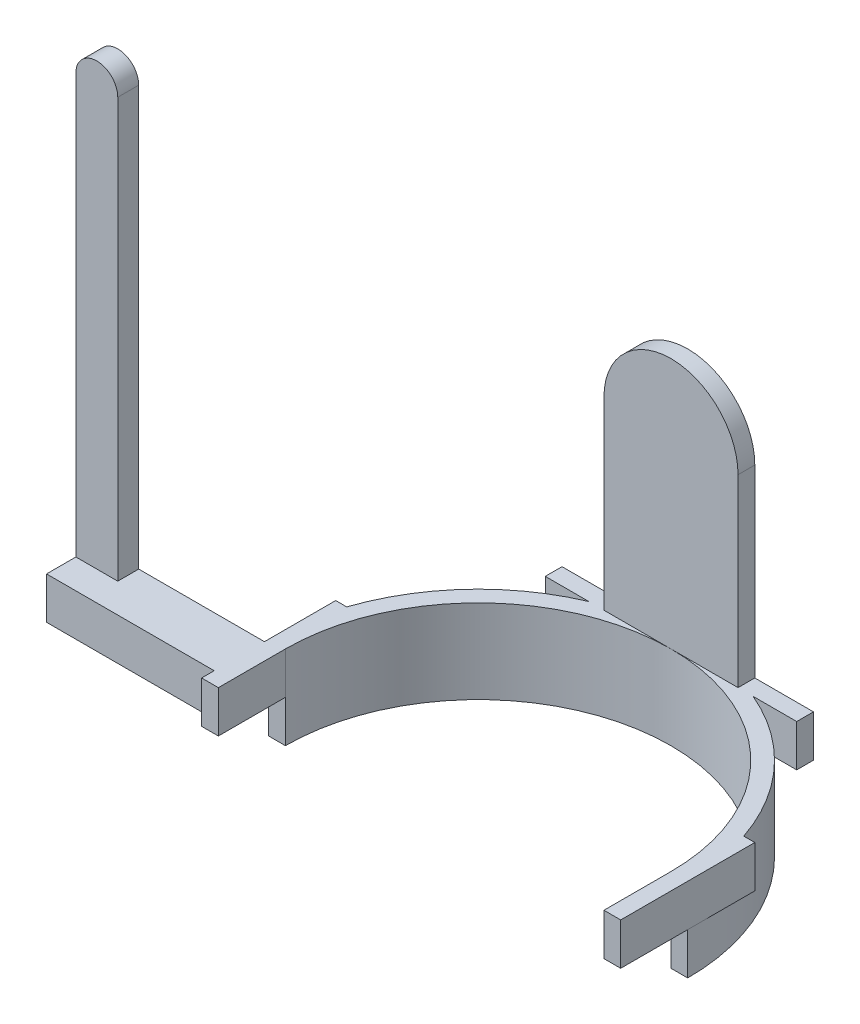
ISO-10303-21;
HEADER;
FILE_DESCRIPTION(('STEP AP214'),'2;1');
FILE_NAME('part.step','',(''),(''),'','','');
FILE_SCHEMA(('AUTOMOTIVE_DESIGN { 1 0 10303 214 1 1 1 1 }'));
ENDSEC;
DATA;
#1=APPLICATION_CONTEXT('core data for automotive mechanical design processes');
#2=APPLICATION_PROTOCOL_DEFINITION('international standard','automotive_design',2000,#1);
#3=PRODUCT_CONTEXT('',#1,'mechanical');
#4=PRODUCT('Part','Part','',(#3));
#5=PRODUCT_RELATED_PRODUCT_CATEGORY('part','',(#4));
#6=PRODUCT_DEFINITION_FORMATION('','',#4);
#7=PRODUCT_DEFINITION_CONTEXT('part definition',#1,'design');
#8=PRODUCT_DEFINITION('design','',#6,#7);
#9=PRODUCT_DEFINITION_SHAPE('','',#8);
#10=(LENGTH_UNIT() NAMED_UNIT(*) SI_UNIT(.MILLI.,.METRE.));
#11=(NAMED_UNIT(*) PLANE_ANGLE_UNIT() SI_UNIT($,.RADIAN.));
#12=(NAMED_UNIT(*) SI_UNIT($,.STERADIAN.) SOLID_ANGLE_UNIT());
#13=UNCERTAINTY_MEASURE_WITH_UNIT(LENGTH_MEASURE(1.E-05),#10,'distance_accuracy_value','');
#14=(GEOMETRIC_REPRESENTATION_CONTEXT(3) GLOBAL_UNCERTAINTY_ASSIGNED_CONTEXT((#13)) GLOBAL_UNIT_ASSIGNED_CONTEXT((#10,
#11,#12)) REPRESENTATION_CONTEXT('',''));
#15=CARTESIAN_POINT('',(0.,0.,0.));
#16=DIRECTION('',(0.,0.,1.));
#17=DIRECTION('',(1.,0.,0.));
#18=AXIS2_PLACEMENT_3D('',#15,#16,#17);
#19=CARTESIAN_POINT('',(0.,20.,0.));
#20=DIRECTION('',(0.,-1.,0.));
#21=DIRECTION('',(0.,0.,-1.));
#22=AXIS2_PLACEMENT_3D('',#19,#20,#21);
#23=PLANE('',#22);
#24=DIRECTION('',(1.,0.,0.));
#25=VECTOR('',#24,1.);
#26=CARTESIAN_POINT('',(-90.,20.,6.));
#27=LINE('',#26,#25);
#28=CARTESIAN_POINT('',(-90.,20.,6.));
#29=VERTEX_POINT('',#28);
#30=CARTESIAN_POINT('',(-80.,20.,6.));
#31=VERTEX_POINT('',#30);
#32=EDGE_CURVE('E262',#29,#31,#27,.T.);
#33=ORIENTED_EDGE('',*,*,#32,.F.);
#34=DIRECTION('',(0.,0.,-1.));
#35=VECTOR('',#34,1.);
#36=CARTESIAN_POINT('',(-90.,20.,1.));
#37=LINE('',#36,#35);
#38=CARTESIAN_POINT('',(-90.,20.,13.));
#39=VERTEX_POINT('',#38);
#40=EDGE_CURVE('E287',#39,#29,#37,.T.);
#41=ORIENTED_EDGE('',*,*,#40,.F.);
#42=DIRECTION('',(1.,0.,0.));
#43=VECTOR('',#42,1.);
#44=CARTESIAN_POINT('',(-90.,20.,13.));
#45=LINE('',#44,#43);
#46=CARTESIAN_POINT('',(-50.,20.,13.));
#47=VERTEX_POINT('',#46);
#48=EDGE_CURVE('E55',#39,#47,#45,.T.);
#49=ORIENTED_EDGE('',*,*,#48,.T.);
#50=DIRECTION('',(0.,0.,1.));
#51=VECTOR('',#50,1.);
#52=CARTESIAN_POINT('',(-50.,20.,-16.));
#53=LINE('',#52,#51);
#54=CARTESIAN_POINT('',(-50.,20.,16.));
#55=VERTEX_POINT('',#54);
#56=EDGE_CURVE('E330',#47,#55,#53,.T.);
#57=ORIENTED_EDGE('',*,*,#56,.T.);
#58=DIRECTION('',(1.,0.,0.));
#59=VECTOR('',#58,1.);
#60=CARTESIAN_POINT('',(-50.,20.,16.));
#61=LINE('',#60,#59);
#62=CARTESIAN_POINT('',(-46.,20.,16.));
#63=VERTEX_POINT('',#62);
#64=EDGE_CURVE('E334',#55,#63,#61,.T.);
#65=ORIENTED_EDGE('',*,*,#64,.T.);
#66=DIRECTION('',(0.,0.,-1.));
#67=VECTOR('',#66,1.);
#68=CARTESIAN_POINT('',(-46.,20.,0.));
#69=LINE('',#68,#67);
#70=CARTESIAN_POINT('',(-46.,20.,0.));
#71=VERTEX_POINT('',#70);
#72=EDGE_CURVE('E336',#63,#71,#69,.T.);
#73=ORIENTED_EDGE('',*,*,#72,.T.);
#74=CARTESIAN_POINT('',(0.,20.,0.));
#75=DIRECTION('',(0.,-1.,0.));
#76=DIRECTION('',(0.,0.,-1.));
#77=AXIS2_PLACEMENT_3D('',#74,#75,#76);
#78=CIRCLE('',#77,46.);
#79=CARTESIAN_POINT('',(0.,20.,-46.));
#80=VERTEX_POINT('',#79);
#81=EDGE_CURVE('E339',#71,#80,#78,.T.);
#82=ORIENTED_EDGE('',*,*,#81,.T.);
#83=DIRECTION('',(1.,0.,0.));
#84=VECTOR('',#83,1.);
#85=CARTESIAN_POINT('',(-16.,20.,-46.));
#86=LINE('',#85,#84);
#87=CARTESIAN_POINT('',(-16.,20.,-46.));
#88=VERTEX_POINT('',#87);
#89=EDGE_CURVE('E48',#88,#80,#86,.T.);
#90=ORIENTED_EDGE('',*,*,#89,.F.);
#91=DIRECTION('',(0.,0.,1.));
#92=VECTOR('',#91,1.);
#93=CARTESIAN_POINT('',(-16.,20.,-50.));
#94=LINE('',#93,#92);
#95=CARTESIAN_POINT('',(-16.,20.,-50.));
#96=VERTEX_POINT('',#95);
#97=EDGE_CURVE('E308',#96,#88,#94,.T.);
#98=ORIENTED_EDGE('',*,*,#97,.F.);
#99=DIRECTION('',(-1.,0.,0.));
#100=VECTOR('',#99,1.);
#101=CARTESIAN_POINT('',(-30.,20.,-50.));
#102=LINE('',#101,#100);
#103=CARTESIAN_POINT('',(-30.,20.,-50.));
#104=VERTEX_POINT('',#103);
#105=EDGE_CURVE('E356',#96,#104,#102,.T.);
#106=ORIENTED_EDGE('',*,*,#105,.T.);
#107=DIRECTION('',(0.,0.,1.));
#108=VECTOR('',#107,1.);
#109=CARTESIAN_POINT('',(-30.,20.,-50.));
#110=LINE('',#109,#108);
#111=CARTESIAN_POINT('',(-30.,20.,-46.));
#112=VERTEX_POINT('',#111);
#113=EDGE_CURVE('E360',#104,#112,#110,.T.);
#114=ORIENTED_EDGE('',*,*,#113,.T.);
#115=DIRECTION('',(1.,0.,0.));
#116=VECTOR('',#115,1.);
#117=CARTESIAN_POINT('',(-30.,20.,-46.));
#118=LINE('',#117,#116);
#119=CARTESIAN_POINT('',(-19.5959179422654,20.,-46.));
#120=VERTEX_POINT('',#119);
#121=EDGE_CURVE('E362',#112,#120,#118,.T.);
#122=ORIENTED_EDGE('',*,*,#121,.T.);
#123=CARTESIAN_POINT('',(0.,20.,0.));
#124=DIRECTION('',(0.,1.,0.));
#125=DIRECTION('',(0.,0.,-1.));
#126=AXIS2_PLACEMENT_3D('',#123,#124,#125);
#127=CIRCLE('',#126,50.);
#128=CARTESIAN_POINT('',(-47.370877129308,20.,-16.));
#129=VERTEX_POINT('',#128);
#130=EDGE_CURVE('E324',#120,#129,#127,.T.);
#131=ORIENTED_EDGE('',*,*,#130,.T.);
#132=DIRECTION('',(-1.,0.,0.));
#133=VECTOR('',#132,1.);
#134=CARTESIAN_POINT('',(-50.,20.,-16.));
#135=LINE('',#134,#133);
#136=CARTESIAN_POINT('',(-50.,20.,-16.));
#137=VERTEX_POINT('',#136);
#138=EDGE_CURVE('E327',#129,#137,#135,.T.);
#139=ORIENTED_EDGE('',*,*,#138,.T.);
#140=CARTESIAN_POINT('',(-50.,20.,1.));
#141=VERTEX_POINT('',#140);
#142=EDGE_CURVE('E331',#137,#141,#53,.T.);
#143=ORIENTED_EDGE('',*,*,#142,.T.);
#144=DIRECTION('',(1.,0.,0.));
#145=VECTOR('',#144,1.);
#146=CARTESIAN_POINT('',(-90.,20.,1.));
#147=LINE('',#146,#145);
#148=CARTESIAN_POINT('',(-80.,20.,1.));
#149=VERTEX_POINT('',#148);
#150=EDGE_CURVE('E290',#149,#141,#147,.T.);
#151=ORIENTED_EDGE('',*,*,#150,.F.);
#152=DIRECTION('',(0.,0.,-1.));
#153=VECTOR('',#152,1.);
#154=CARTESIAN_POINT('',(-80.,20.,1.));
#155=LINE('',#154,#153);
#156=EDGE_CURVE('E272',#31,#149,#155,.T.);
#157=ORIENTED_EDGE('',*,*,#156,.F.);
#158=EDGE_LOOP('',(#33,#41,#49,#57,#65,#73,#82,#90,#98,#106,#114,#122,#131,#139,#143,#151,#157));
#159=FACE_BOUND('',#158,.T.);
#160=ADVANCED_FACE('F38',(#159),#23,.F.);
#161=CARTESIAN_POINT('',(-50.,20.,-16.));
#162=DIRECTION('',(1.,0.,0.));
#163=DIRECTION('',(0.,0.,-1.));
#164=AXIS2_PLACEMENT_3D('',#161,#162,#163);
#165=PLANE('',#164);
#166=DIRECTION('',(0.,-1.,0.));
#167=VECTOR('',#166,1.);
#168=CARTESIAN_POINT('',(-50.,20.,1.));
#169=LINE('',#168,#167);
#170=CARTESIAN_POINT('',(-50.,10.,1.));
#171=VERTEX_POINT('',#170);
#172=EDGE_CURVE('E278',#141,#171,#169,.T.);
#173=ORIENTED_EDGE('',*,*,#172,.F.);
#174=ORIENTED_EDGE('',*,*,#142,.F.);
#175=DIRECTION('',(0.,-1.,0.));
#176=VECTOR('',#175,1.);
#177=CARTESIAN_POINT('',(-50.,20.,-16.));
#178=LINE('',#177,#176);
#179=CARTESIAN_POINT('',(-50.,10.,-16.));
#180=VERTEX_POINT('',#179);
#181=EDGE_CURVE('E440',#137,#180,#178,.T.);
#182=ORIENTED_EDGE('',*,*,#181,.T.);
#183=DIRECTION('',(0.,0.,1.));
#184=VECTOR('',#183,1.);
#185=CARTESIAN_POINT('',(-50.,10.,-16.));
#186=LINE('',#185,#184);
#187=CARTESIAN_POINT('',(-50.,10.,0.));
#188=VERTEX_POINT('',#187);
#189=EDGE_CURVE('E367',#180,#188,#186,.T.);
#190=ORIENTED_EDGE('',*,*,#189,.T.);
#191=EDGE_CURVE('E371',#188,#171,#186,.T.);
#192=ORIENTED_EDGE('',*,*,#191,.T.);
#193=EDGE_LOOP('',(#173,#174,#182,#190,#192));
#194=FACE_BOUND('',#193,.T.);
#195=ADVANCED_FACE('F552',(#194),#165,.F.);
#196=DIRECTION('',(0.,1.,0.));
#197=VECTOR('',#196,1.);
#198=CARTESIAN_POINT('',(-50.,20.,13.));
#199=LINE('',#198,#197);
#200=CARTESIAN_POINT('',(-50.,10.,13.));
#201=VERTEX_POINT('',#200);
#202=EDGE_CURVE('E283',#201,#47,#199,.T.);
#203=ORIENTED_EDGE('',*,*,#202,.F.);
#204=CARTESIAN_POINT('',(-50.,10.,16.));
#205=VERTEX_POINT('',#204);
#206=EDGE_CURVE('E366',#201,#205,#186,.T.);
#207=ORIENTED_EDGE('',*,*,#206,.T.);
#208=DIRECTION('',(0.,-1.,0.));
#209=VECTOR('',#208,1.);
#210=CARTESIAN_POINT('',(-50.,20.,16.));
#211=LINE('',#210,#209);
#212=EDGE_CURVE('E437',#55,#205,#211,.T.);
#213=ORIENTED_EDGE('',*,*,#212,.F.);
#214=ORIENTED_EDGE('',*,*,#56,.F.);
#215=EDGE_LOOP('',(#203,#207,#213,#214));
#216=FACE_BOUND('',#215,.T.);
#217=ADVANCED_FACE('F570',(#216),#165,.F.);
#218=CARTESIAN_POINT('',(-16.,80.,-50.));
#219=DIRECTION('',(1.,0.,0.));
#220=DIRECTION('',(0.,0.,-1.));
#221=AXIS2_PLACEMENT_3D('',#218,#219,#220);
#222=PLANE('',#221);
#223=DIRECTION('',(0.,0.,-1.));
#224=VECTOR('',#223,1.);
#225=CARTESIAN_POINT('',(-16.,64.,-20.));
#226=LINE('',#225,#224);
#227=CARTESIAN_POINT('',(-16.,64.,-46.));
#228=VERTEX_POINT('',#227);
#229=CARTESIAN_POINT('',(-16.,64.,-50.));
#230=VERTEX_POINT('',#229);
#231=EDGE_CURVE('E302',#228,#230,#226,.T.);
#232=ORIENTED_EDGE('',*,*,#231,.T.);
#233=DIRECTION('',(0.,-1.,0.));
#234=VECTOR('',#233,1.);
#235=CARTESIAN_POINT('',(-16.,80.,-50.));
#236=LINE('',#235,#234);
#237=EDGE_CURVE('E315',#230,#96,#236,.T.);
#238=ORIENTED_EDGE('',*,*,#237,.T.);
#239=ORIENTED_EDGE('',*,*,#97,.T.);
#240=DIRECTION('',(0.,-1.,0.));
#241=VECTOR('',#240,1.);
#242=CARTESIAN_POINT('',(-16.,80.,-46.));
#243=LINE('',#242,#241);
#244=EDGE_CURVE('E321',#228,#88,#243,.T.);
#245=ORIENTED_EDGE('',*,*,#244,.F.);
#246=EDGE_LOOP('',(#232,#238,#239,#245));
#247=FACE_BOUND('',#246,.T.);
#248=ADVANCED_FACE('F524',(#247),#222,.F.);
#249=DIRECTION('',(0.,0.,-1.));
#250=VECTOR('',#249,1.);
#251=CARTESIAN_POINT('',(16.,20.,-50.));
#252=LINE('',#251,#250);
#253=CARTESIAN_POINT('',(16.,20.,-46.));
#254=VERTEX_POINT('',#253);
#255=CARTESIAN_POINT('',(16.,20.,-50.));
#256=VERTEX_POINT('',#255);
#257=EDGE_CURVE('E312',#254,#256,#252,.T.);
#258=ORIENTED_EDGE('',*,*,#257,.F.);
#259=EDGE_CURVE('E11',#80,#254,#86,.T.);
#260=ORIENTED_EDGE('',*,*,#259,.F.);
#261=CARTESIAN_POINT('',(46.,20.,0.));
#262=VERTEX_POINT('',#261);
#263=EDGE_CURVE('E338',#80,#262,#78,.T.);
#264=ORIENTED_EDGE('',*,*,#263,.T.);
#265=DIRECTION('',(0.,0.,1.));
#266=VECTOR('',#265,1.);
#267=CARTESIAN_POINT('',(46.,20.,0.));
#268=LINE('',#267,#266);
#269=CARTESIAN_POINT('',(46.,20.,16.));
#270=VERTEX_POINT('',#269);
#271=EDGE_CURVE('E342',#262,#270,#268,.T.);
#272=ORIENTED_EDGE('',*,*,#271,.T.);
#273=DIRECTION('',(1.,0.,0.));
#274=VECTOR('',#273,1.);
#275=CARTESIAN_POINT('',(50.,20.,16.));
#276=LINE('',#275,#274);
#277=CARTESIAN_POINT('',(50.,20.,16.));
#278=VERTEX_POINT('',#277);
#279=EDGE_CURVE('E344',#270,#278,#276,.T.);
#280=ORIENTED_EDGE('',*,*,#279,.T.);
#281=DIRECTION('',(0.,0.,-1.));
#282=VECTOR('',#281,1.);
#283=CARTESIAN_POINT('',(50.,20.,-16.));
#284=LINE('',#283,#282);
#285=CARTESIAN_POINT('',(50.,20.,-16.));
#286=VERTEX_POINT('',#285);
#287=EDGE_CURVE('E346',#278,#286,#284,.T.);
#288=ORIENTED_EDGE('',*,*,#287,.T.);
#289=DIRECTION('',(-1.,0.,0.));
#290=VECTOR('',#289,1.);
#291=CARTESIAN_POINT('',(50.,20.,-16.));
#292=LINE('',#291,#290);
#293=CARTESIAN_POINT('',(47.370877129308,20.,-16.));
#294=VERTEX_POINT('',#293);
#295=EDGE_CURVE('E348',#286,#294,#292,.T.);
#296=ORIENTED_EDGE('',*,*,#295,.T.);
#297=CARTESIAN_POINT('',(0.,20.,0.));
#298=DIRECTION('',(0.,1.,0.));
#299=DIRECTION('',(0.,0.,-1.));
#300=AXIS2_PLACEMENT_3D('',#297,#298,#299);
#301=CIRCLE('',#300,50.);
#302=CARTESIAN_POINT('',(19.5959179422654,20.,-46.));
#303=VERTEX_POINT('',#302);
#304=EDGE_CURVE('E350',#294,#303,#301,.T.);
#305=ORIENTED_EDGE('',*,*,#304,.T.);
#306=DIRECTION('',(1.,0.,0.));
#307=VECTOR('',#306,1.);
#308=CARTESIAN_POINT('',(19.5959179422654,20.,-46.));
#309=LINE('',#308,#307);
#310=CARTESIAN_POINT('',(30.,20.,-46.));
#311=VERTEX_POINT('',#310);
#312=EDGE_CURVE('E352',#303,#311,#309,.T.);
#313=ORIENTED_EDGE('',*,*,#312,.T.);
#314=DIRECTION('',(0.,0.,-1.));
#315=VECTOR('',#314,1.);
#316=CARTESIAN_POINT('',(30.,20.,-50.));
#317=LINE('',#316,#315);
#318=CARTESIAN_POINT('',(30.,20.,-50.));
#319=VERTEX_POINT('',#318);
#320=EDGE_CURVE('E354',#311,#319,#317,.T.);
#321=ORIENTED_EDGE('',*,*,#320,.T.);
#322=EDGE_CURVE('E357',#319,#256,#102,.T.);
#323=ORIENTED_EDGE('',*,*,#322,.T.);
#324=EDGE_LOOP('',(#258,#260,#264,#272,#280,#288,#296,#305,#313,#321,#323));
#325=FACE_BOUND('',#324,.T.);
#326=ADVANCED_FACE('F512',(#325),#23,.F.);
#327=CARTESIAN_POINT('',(0.,10.,0.));
#328=DIRECTION('',(0.,-1.,0.));
#329=DIRECTION('',(0.,0.,-1.));
#330=AXIS2_PLACEMENT_3D('',#327,#328,#329);
#331=CYLINDRICAL_SURFACE('',#330,50.);
#332=CARTESIAN_POINT('',(0.,0.,0.));
#333=DIRECTION('',(0.,1.,0.));
#334=DIRECTION('',(0.,0.,-1.));
#335=AXIS2_PLACEMENT_3D('',#332,#333,#334);
#336=CIRCLE('',#335,50.);
#337=CARTESIAN_POINT('',(50.,0.,0.));
#338=VERTEX_POINT('',#337);
#339=CARTESIAN_POINT('',(-50.,0.,0.));
#340=VERTEX_POINT('',#339);
#341=EDGE_CURVE('E446',#338,#340,#336,.T.);
#342=ORIENTED_EDGE('',*,*,#341,.T.);
#343=DIRECTION('',(0.,-1.,0.));
#344=VECTOR('',#343,1.);
#345=CARTESIAN_POINT('',(-50.,10.,0.));
#346=LINE('',#345,#344);
#347=EDGE_CURVE('E42',#188,#340,#346,.T.);
#348=ORIENTED_EDGE('',*,*,#347,.F.);
#349=CARTESIAN_POINT('',(0.,10.,0.));
#350=DIRECTION('',(0.,1.,0.));
#351=DIRECTION('',(0.,0.,-1.));
#352=AXIS2_PLACEMENT_3D('',#349,#350,#351);
#353=CIRCLE('',#352,50.);
#354=CARTESIAN_POINT('',(-47.370877129308,10.,-16.));
#355=VERTEX_POINT('',#354);
#356=EDGE_CURVE('E451',#355,#188,#353,.T.);
#357=ORIENTED_EDGE('',*,*,#356,.F.);
#358=DIRECTION('',(0.,-1.,0.));
#359=VECTOR('',#358,1.);
#360=CARTESIAN_POINT('',(-47.370877129308,20.,-16.));
#361=LINE('',#360,#359);
#362=EDGE_CURVE('E443',#129,#355,#361,.T.);
#363=ORIENTED_EDGE('',*,*,#362,.F.);
#364=ORIENTED_EDGE('',*,*,#130,.F.);
#365=DIRECTION('',(0.,-1.,0.));
#366=VECTOR('',#365,1.);
#367=CARTESIAN_POINT('',(-19.5959179422654,20.,-46.));
#368=LINE('',#367,#366);
#369=CARTESIAN_POINT('',(-19.5959179422654,10.,-46.));
#370=VERTEX_POINT('',#369);
#371=EDGE_CURVE('E364',#120,#370,#368,.T.);
#372=ORIENTED_EDGE('',*,*,#371,.T.);
#373=CARTESIAN_POINT('',(0.,10.,-50.));
#374=VERTEX_POINT('',#373);
#375=EDGE_CURVE('E583',#374,#370,#353,.T.);
#376=ORIENTED_EDGE('',*,*,#375,.F.);
#377=CARTESIAN_POINT('',(19.5959179422654,10.,-46.));
#378=VERTEX_POINT('',#377);
#379=EDGE_CURVE('E450',#378,#374,#353,.T.);
#380=ORIENTED_EDGE('',*,*,#379,.F.);
#381=DIRECTION('',(0.,-1.,0.));
#382=VECTOR('',#381,1.);
#383=CARTESIAN_POINT('',(19.5959179422654,20.,-46.));
#384=LINE('',#383,#382);
#385=EDGE_CURVE('E413',#303,#378,#384,.T.);
#386=ORIENTED_EDGE('',*,*,#385,.F.);
#387=ORIENTED_EDGE('',*,*,#304,.F.);
#388=DIRECTION('',(0.,-1.,0.));
#389=VECTOR('',#388,1.);
#390=CARTESIAN_POINT('',(47.370877129308,20.,-16.));
#391=LINE('',#390,#389);
#392=CARTESIAN_POINT('',(47.370877129308,10.,-16.));
#393=VERTEX_POINT('',#392);
#394=EDGE_CURVE('E416',#294,#393,#391,.T.);
#395=ORIENTED_EDGE('',*,*,#394,.T.);
#396=CARTESIAN_POINT('',(50.,10.,0.));
#397=VERTEX_POINT('',#396);
#398=EDGE_CURVE('E447',#397,#393,#353,.T.);
#399=ORIENTED_EDGE('',*,*,#398,.F.);
#400=DIRECTION('',(0.,-1.,0.));
#401=VECTOR('',#400,1.);
#402=CARTESIAN_POINT('',(50.,10.,0.));
#403=LINE('',#402,#401);
#404=EDGE_CURVE('E457',#397,#338,#403,.T.);
#405=ORIENTED_EDGE('',*,*,#404,.T.);
#406=EDGE_LOOP('',(#342,#348,#357,#363,#364,#372,#376,#380,#386,#387,#395,#399,#405));
#407=FACE_BOUND('',#406,.T.);
#408=ADVANCED_FACE('F40',(#407),#331,.T.);
#409=CARTESIAN_POINT('',(-50.,10.,0.));
#410=DIRECTION('',(0.,0.,-1.));
#411=DIRECTION('',(-1.,0.,0.));
#412=AXIS2_PLACEMENT_3D('',#409,#410,#411);
#413=PLANE('',#412);
#414=DIRECTION('',(1.,0.,0.));
#415=VECTOR('',#414,1.);
#416=CARTESIAN_POINT('',(-50.,0.,0.));
#417=LINE('',#416,#415);
#418=CARTESIAN_POINT('',(-46.,0.,0.));
#419=VERTEX_POINT('',#418);
#420=EDGE_CURVE('E460',#340,#419,#417,.T.);
#421=ORIENTED_EDGE('',*,*,#420,.T.);
#422=DIRECTION('',(0.,-1.,0.));
#423=VECTOR('',#422,1.);
#424=CARTESIAN_POINT('',(-46.,10.,0.));
#425=LINE('',#424,#423);
#426=CARTESIAN_POINT('',(-46.,10.,0.));
#427=VERTEX_POINT('',#426);
#428=EDGE_CURVE('E470',#427,#419,#425,.T.);
#429=ORIENTED_EDGE('',*,*,#428,.F.);
#430=DIRECTION('',(1.,0.,0.));
#431=VECTOR('',#430,1.);
#432=CARTESIAN_POINT('',(-50.,10.,0.));
#433=LINE('',#432,#431);
#434=EDGE_CURVE('E449',#188,#427,#433,.T.);
#435=ORIENTED_EDGE('',*,*,#434,.F.);
#436=ORIENTED_EDGE('',*,*,#347,.T.);
#437=EDGE_LOOP('',(#421,#429,#435,#436));
#438=FACE_BOUND('',#437,.T.);
#439=ADVANCED_FACE('F477',(#438),#413,.F.);
#440=CARTESIAN_POINT('',(0.,10.,0.));
#441=DIRECTION('',(0.,-1.,0.));
#442=DIRECTION('',(0.,0.,-1.));
#443=AXIS2_PLACEMENT_3D('',#440,#441,#442);
#444=CYLINDRICAL_SURFACE('',#443,46.);
#445=CARTESIAN_POINT('',(0.,0.,0.));
#446=DIRECTION('',(0.,-1.,0.));
#447=DIRECTION('',(0.,0.,-1.));
#448=AXIS2_PLACEMENT_3D('',#445,#446,#447);
#449=CIRCLE('',#448,46.);
#450=CARTESIAN_POINT('',(46.,0.,0.));
#451=VERTEX_POINT('',#450);
#452=EDGE_CURVE('E462',#419,#451,#449,.T.);
#453=ORIENTED_EDGE('',*,*,#452,.T.);
#454=DIRECTION('',(0.,-1.,0.));
#455=VECTOR('',#454,1.);
#456=CARTESIAN_POINT('',(46.,10.,0.));
#457=LINE('',#456,#455);
#458=CARTESIAN_POINT('',(46.,10.,0.));
#459=VERTEX_POINT('',#458);
#460=EDGE_CURVE('E468',#459,#451,#457,.T.);
#461=ORIENTED_EDGE('',*,*,#460,.F.);
#462=DIRECTION('',(0.,-1.,0.));
#463=VECTOR('',#462,1.);
#464=CARTESIAN_POINT('',(46.,20.,0.));
#465=LINE('',#464,#463);
#466=EDGE_CURVE('E428',#262,#459,#465,.T.);
#467=ORIENTED_EDGE('',*,*,#466,.F.);
#468=ORIENTED_EDGE('',*,*,#263,.F.);
#469=ORIENTED_EDGE('',*,*,#81,.F.);
#470=DIRECTION('',(0.,-1.,0.));
#471=VECTOR('',#470,1.);
#472=CARTESIAN_POINT('',(-46.,20.,0.));
#473=LINE('',#472,#471);
#474=EDGE_CURVE('E431',#71,#427,#473,.T.);
#475=ORIENTED_EDGE('',*,*,#474,.T.);
#476=ORIENTED_EDGE('',*,*,#428,.T.);
#477=EDGE_LOOP('',(#453,#461,#467,#468,#469,#475,#476));
#478=FACE_BOUND('',#477,.T.);
#479=ADVANCED_FACE('F485',(#478),#444,.F.);
#480=CARTESIAN_POINT('',(46.,10.,0.));
#481=DIRECTION('',(0.,0.,-1.));
#482=DIRECTION('',(-1.,0.,0.));
#483=AXIS2_PLACEMENT_3D('',#480,#481,#482);
#484=PLANE('',#483);
#485=DIRECTION('',(1.,0.,0.));
#486=VECTOR('',#485,1.);
#487=CARTESIAN_POINT('',(46.,0.,0.));
#488=LINE('',#487,#486);
#489=EDGE_CURVE('E464',#451,#338,#488,.T.);
#490=ORIENTED_EDGE('',*,*,#489,.T.);
#491=ORIENTED_EDGE('',*,*,#404,.F.);
#492=DIRECTION('',(1.,0.,0.));
#493=VECTOR('',#492,1.);
#494=CARTESIAN_POINT('',(46.,10.,0.));
#495=LINE('',#494,#493);
#496=EDGE_CURVE('E454',#459,#397,#495,.T.);
#497=ORIENTED_EDGE('',*,*,#496,.F.);
#498=ORIENTED_EDGE('',*,*,#460,.T.);
#499=EDGE_LOOP('',(#490,#491,#497,#498));
#500=FACE_BOUND('',#499,.T.);
#501=ADVANCED_FACE('F489',(#500),#484,.F.);
#502=CARTESIAN_POINT('',(0.,0.,0.));
#503=DIRECTION('',(0.,-1.,0.));
#504=DIRECTION('',(0.,0.,-1.));
#505=AXIS2_PLACEMENT_3D('',#502,#503,#504);
#506=PLANE('',#505);
#507=ORIENTED_EDGE('',*,*,#341,.F.);
#508=ORIENTED_EDGE('',*,*,#489,.F.);
#509=ORIENTED_EDGE('',*,*,#452,.F.);
#510=ORIENTED_EDGE('',*,*,#420,.F.);
#511=EDGE_LOOP('',(#507,#508,#509,#510));
#512=FACE_BOUND('',#511,.T.);
#513=ADVANCED_FACE('F484',(#512),#506,.T.);
#514=CARTESIAN_POINT('',(0.,10.,0.));
#515=DIRECTION('',(0.,-1.,0.));
#516=DIRECTION('',(0.,0.,-1.));
#517=AXIS2_PLACEMENT_3D('',#514,#515,#516);
#518=PLANE('',#517);
#519=DIRECTION('',(1.,0.,0.));
#520=VECTOR('',#519,1.);
#521=CARTESIAN_POINT('',(19.5959179422654,10.,-46.));
#522=LINE('',#521,#520);
#523=CARTESIAN_POINT('',(30.,10.,-46.));
#524=VERTEX_POINT('',#523);
#525=EDGE_CURVE('E387',#378,#524,#522,.T.);
#526=ORIENTED_EDGE('',*,*,#525,.F.);
#527=ORIENTED_EDGE('',*,*,#379,.T.);
#528=DIRECTION('',(-1.,0.,0.));
#529=VECTOR('',#528,1.);
#530=CARTESIAN_POINT('',(-30.,10.,-50.));
#531=LINE('',#530,#529);
#532=CARTESIAN_POINT('',(30.,10.,-50.));
#533=VERTEX_POINT('',#532);
#534=EDGE_CURVE('E392',#533,#374,#531,.T.);
#535=ORIENTED_EDGE('',*,*,#534,.F.);
#536=DIRECTION('',(0.,0.,-1.));
#537=VECTOR('',#536,1.);
#538=CARTESIAN_POINT('',(30.,10.,-50.));
#539=LINE('',#538,#537);
#540=EDGE_CURVE('E389',#524,#533,#539,.T.);
#541=ORIENTED_EDGE('',*,*,#540,.F.);
#542=EDGE_LOOP('',(#526,#527,#535,#541));
#543=FACE_BOUND('',#542,.T.);
#544=ADVANCED_FACE('F589',(#543),#518,.T.);
#545=CARTESIAN_POINT('',(-30.,10.,-50.));
#546=VERTEX_POINT('',#545);
#547=EDGE_CURVE('E391',#374,#546,#531,.T.);
#548=ORIENTED_EDGE('',*,*,#547,.F.);
#549=ORIENTED_EDGE('',*,*,#375,.T.);
#550=DIRECTION('',(1.,0.,0.));
#551=VECTOR('',#550,1.);
#552=CARTESIAN_POINT('',(-30.,10.,-46.));
#553=LINE('',#552,#551);
#554=CARTESIAN_POINT('',(-30.,10.,-46.));
#555=VERTEX_POINT('',#554);
#556=EDGE_CURVE('E328',#555,#370,#553,.T.);
#557=ORIENTED_EDGE('',*,*,#556,.F.);
#558=DIRECTION('',(0.,0.,1.));
#559=VECTOR('',#558,1.);
#560=CARTESIAN_POINT('',(-30.,10.,-50.));
#561=LINE('',#560,#559);
#562=EDGE_CURVE('E395',#546,#555,#561,.T.);
#563=ORIENTED_EDGE('',*,*,#562,.F.);
#564=EDGE_LOOP('',(#548,#549,#557,#563));
#565=FACE_BOUND('',#564,.T.);
#566=ADVANCED_FACE('F592',(#565),#518,.T.);
#567=DIRECTION('',(-1.,0.,0.));
#568=VECTOR('',#567,1.);
#569=CARTESIAN_POINT('',(-50.,10.,-16.));
#570=LINE('',#569,#568);
#571=EDGE_CURVE('E323',#355,#180,#570,.T.);
#572=ORIENTED_EDGE('',*,*,#571,.F.);
#573=ORIENTED_EDGE('',*,*,#356,.T.);
#574=ORIENTED_EDGE('',*,*,#189,.F.);
#575=EDGE_LOOP('',(#572,#573,#574));
#576=FACE_BOUND('',#575,.T.);
#577=ADVANCED_FACE('F582',(#576),#518,.T.);
#578=ORIENTED_EDGE('',*,*,#191,.F.);
#579=ORIENTED_EDGE('',*,*,#434,.T.);
#580=DIRECTION('',(0.,0.,-1.));
#581=VECTOR('',#580,1.);
#582=CARTESIAN_POINT('',(-46.,10.,0.));
#583=LINE('',#582,#581);
#584=CARTESIAN_POINT('',(-46.,10.,16.));
#585=VERTEX_POINT('',#584);
#586=EDGE_CURVE('E373',#585,#427,#583,.T.);
#587=ORIENTED_EDGE('',*,*,#586,.F.);
#588=DIRECTION('',(1.,0.,0.));
#589=VECTOR('',#588,1.);
#590=CARTESIAN_POINT('',(-50.,10.,16.));
#591=LINE('',#590,#589);
#592=EDGE_CURVE('E370',#205,#585,#591,.T.);
#593=ORIENTED_EDGE('',*,*,#592,.F.);
#594=ORIENTED_EDGE('',*,*,#206,.F.);
#595=DIRECTION('',(1.,0.,0.));
#596=VECTOR('',#595,1.);
#597=CARTESIAN_POINT('',(-90.,10.,13.));
#598=LINE('',#597,#596);
#599=CARTESIAN_POINT('',(-90.,10.,13.));
#600=VERTEX_POINT('',#599);
#601=EDGE_CURVE('E296',#600,#201,#598,.T.);
#602=ORIENTED_EDGE('',*,*,#601,.F.);
#603=DIRECTION('',(0.,0.,1.));
#604=VECTOR('',#603,1.);
#605=CARTESIAN_POINT('',(-90.,10.,1.));
#606=LINE('',#605,#604);
#607=CARTESIAN_POINT('',(-90.,10.,1.));
#608=VERTEX_POINT('',#607);
#609=EDGE_CURVE('E282',#608,#600,#606,.T.);
#610=ORIENTED_EDGE('',*,*,#609,.F.);
#611=DIRECTION('',(1.,0.,0.));
#612=VECTOR('',#611,1.);
#613=CARTESIAN_POINT('',(-90.,10.,1.));
#614=LINE('',#613,#612);
#615=EDGE_CURVE('E298',#608,#171,#614,.T.);
#616=ORIENTED_EDGE('',*,*,#615,.T.);
#617=EDGE_LOOP('',(#578,#579,#587,#593,#594,#602,#610,#616));
#618=FACE_BOUND('',#617,.T.);
#619=ADVANCED_FACE('F580',(#618),#518,.T.);
#620=DIRECTION('',(0.,0.,-1.));
#621=VECTOR('',#620,1.);
#622=CARTESIAN_POINT('',(50.,10.,-16.));
#623=LINE('',#622,#621);
#624=CARTESIAN_POINT('',(50.,10.,-16.));
#625=VERTEX_POINT('',#624);
#626=EDGE_CURVE('E380',#397,#625,#623,.T.);
#627=ORIENTED_EDGE('',*,*,#626,.F.);
#628=ORIENTED_EDGE('',*,*,#398,.T.);
#629=DIRECTION('',(-1.,0.,0.));
#630=VECTOR('',#629,1.);
#631=CARTESIAN_POINT('',(50.,10.,-16.));
#632=LINE('',#631,#630);
#633=EDGE_CURVE('E384',#625,#393,#632,.T.);
#634=ORIENTED_EDGE('',*,*,#633,.F.);
#635=EDGE_LOOP('',(#627,#628,#634));
#636=FACE_BOUND('',#635,.T.);
#637=ADVANCED_FACE('F636',(#636),#518,.T.);
#638=CARTESIAN_POINT('',(-50.,20.,-16.));
#639=DIRECTION('',(0.,0.,1.));
#640=DIRECTION('',(1.,0.,0.));
#641=AXIS2_PLACEMENT_3D('',#638,#639,#640);
#642=PLANE('',#641);
#643=ORIENTED_EDGE('',*,*,#571,.T.);
#644=ORIENTED_EDGE('',*,*,#181,.F.);
#645=ORIENTED_EDGE('',*,*,#138,.F.);
#646=ORIENTED_EDGE('',*,*,#362,.T.);
#647=EDGE_LOOP('',(#643,#644,#645,#646));
#648=FACE_BOUND('',#647,.T.);
#649=ADVANCED_FACE('F546',(#648),#642,.F.);
#650=CARTESIAN_POINT('',(-50.,20.,16.));
#651=DIRECTION('',(0.,0.,-1.));
#652=DIRECTION('',(-1.,0.,0.));
#653=AXIS2_PLACEMENT_3D('',#650,#651,#652);
#654=PLANE('',#653);
#655=ORIENTED_EDGE('',*,*,#592,.T.);
#656=DIRECTION('',(0.,-1.,0.));
#657=VECTOR('',#656,1.);
#658=CARTESIAN_POINT('',(-46.,20.,16.));
#659=LINE('',#658,#657);
#660=EDGE_CURVE('E434',#63,#585,#659,.T.);
#661=ORIENTED_EDGE('',*,*,#660,.F.);
#662=ORIENTED_EDGE('',*,*,#64,.F.);
#663=ORIENTED_EDGE('',*,*,#212,.T.);
#664=EDGE_LOOP('',(#655,#661,#662,#663));
#665=FACE_BOUND('',#664,.T.);
#666=ADVANCED_FACE('F574',(#665),#654,.F.);
#667=CARTESIAN_POINT('',(-46.,20.,0.));
#668=DIRECTION('',(-1.,0.,0.));
#669=DIRECTION('',(0.,0.,1.));
#670=AXIS2_PLACEMENT_3D('',#667,#668,#669);
#671=PLANE('',#670);
#672=ORIENTED_EDGE('',*,*,#586,.T.);
#673=ORIENTED_EDGE('',*,*,#474,.F.);
#674=ORIENTED_EDGE('',*,*,#72,.F.);
#675=ORIENTED_EDGE('',*,*,#660,.T.);
#676=EDGE_LOOP('',(#672,#673,#674,#675));
#677=FACE_BOUND('',#676,.T.);
#678=ADVANCED_FACE('F578',(#677),#671,.F.);
#679=CARTESIAN_POINT('',(46.,20.,0.));
#680=DIRECTION('',(1.,0.,0.));
#681=DIRECTION('',(0.,0.,-1.));
#682=AXIS2_PLACEMENT_3D('',#679,#680,#681);
#683=PLANE('',#682);
#684=DIRECTION('',(0.,0.,1.));
#685=VECTOR('',#684,1.);
#686=CARTESIAN_POINT('',(46.,10.,0.));
#687=LINE('',#686,#685);
#688=CARTESIAN_POINT('',(46.,10.,16.));
#689=VERTEX_POINT('',#688);
#690=EDGE_CURVE('E376',#459,#689,#687,.T.);
#691=ORIENTED_EDGE('',*,*,#690,.T.);
#692=DIRECTION('',(0.,-1.,0.));
#693=VECTOR('',#692,1.);
#694=CARTESIAN_POINT('',(46.,20.,16.));
#695=LINE('',#694,#693);
#696=EDGE_CURVE('E425',#270,#689,#695,.T.);
#697=ORIENTED_EDGE('',*,*,#696,.F.);
#698=ORIENTED_EDGE('',*,*,#271,.F.);
#699=ORIENTED_EDGE('',*,*,#466,.T.);
#700=EDGE_LOOP('',(#691,#697,#698,#699));
#701=FACE_BOUND('',#700,.T.);
#702=ADVANCED_FACE('F496',(#701),#683,.F.);
#703=CARTESIAN_POINT('',(50.,20.,16.));
#704=DIRECTION('',(0.,0.,-1.));
#705=DIRECTION('',(-1.,0.,0.));
#706=AXIS2_PLACEMENT_3D('',#703,#704,#705);
#707=PLANE('',#706);
#708=DIRECTION('',(1.,0.,0.));
#709=VECTOR('',#708,1.);
#710=CARTESIAN_POINT('',(50.,10.,16.));
#711=LINE('',#710,#709);
#712=CARTESIAN_POINT('',(50.,10.,16.));
#713=VERTEX_POINT('',#712);
#714=EDGE_CURVE('E378',#689,#713,#711,.T.);
#715=ORIENTED_EDGE('',*,*,#714,.T.);
#716=DIRECTION('',(0.,-1.,0.));
#717=VECTOR('',#716,1.);
#718=CARTESIAN_POINT('',(50.,20.,16.));
#719=LINE('',#718,#717);
#720=EDGE_CURVE('E422',#278,#713,#719,.T.);
#721=ORIENTED_EDGE('',*,*,#720,.F.);
#722=ORIENTED_EDGE('',*,*,#279,.F.);
#723=ORIENTED_EDGE('',*,*,#696,.T.);
#724=EDGE_LOOP('',(#715,#721,#722,#723));
#725=FACE_BOUND('',#724,.T.);
#726=ADVANCED_FACE('F503',(#725),#707,.F.);
#727=CARTESIAN_POINT('',(50.,20.,-16.));
#728=DIRECTION('',(-1.,0.,0.));
#729=DIRECTION('',(0.,0.,1.));
#730=AXIS2_PLACEMENT_3D('',#727,#728,#729);
#731=PLANE('',#730);
#732=EDGE_CURVE('E381',#713,#397,#623,.T.);
#733=ORIENTED_EDGE('',*,*,#732,.T.);
#734=ORIENTED_EDGE('',*,*,#626,.T.);
#735=DIRECTION('',(0.,-1.,0.));
#736=VECTOR('',#735,1.);
#737=CARTESIAN_POINT('',(50.,20.,-16.));
#738=LINE('',#737,#736);
#739=EDGE_CURVE('E419',#286,#625,#738,.T.);
#740=ORIENTED_EDGE('',*,*,#739,.F.);
#741=ORIENTED_EDGE('',*,*,#287,.F.);
#742=ORIENTED_EDGE('',*,*,#720,.T.);
#743=EDGE_LOOP('',(#733,#734,#740,#741,#742));
#744=FACE_BOUND('',#743,.T.);
#745=ADVANCED_FACE('F507',(#744),#731,.F.);
#746=CARTESIAN_POINT('',(50.,20.,-16.));
#747=DIRECTION('',(0.,0.,1.));
#748=DIRECTION('',(1.,0.,0.));
#749=AXIS2_PLACEMENT_3D('',#746,#747,#748);
#750=PLANE('',#749);
#751=ORIENTED_EDGE('',*,*,#633,.T.);
#752=ORIENTED_EDGE('',*,*,#394,.F.);
#753=ORIENTED_EDGE('',*,*,#295,.F.);
#754=ORIENTED_EDGE('',*,*,#739,.T.);
#755=EDGE_LOOP('',(#751,#752,#753,#754));
#756=FACE_BOUND('',#755,.T.);
#757=ADVANCED_FACE('F651',(#756),#750,.F.);
#758=CARTESIAN_POINT('',(19.5959179422654,20.,-46.));
#759=DIRECTION('',(0.,0.,-1.));
#760=DIRECTION('',(-1.,0.,0.));
#761=AXIS2_PLACEMENT_3D('',#758,#759,#760);
#762=PLANE('',#761);
#763=ORIENTED_EDGE('',*,*,#525,.T.);
#764=DIRECTION('',(0.,-1.,0.));
#765=VECTOR('',#764,1.);
#766=CARTESIAN_POINT('',(30.,20.,-46.));
#767=LINE('',#766,#765);
#768=EDGE_CURVE('E410',#311,#524,#767,.T.);
#769=ORIENTED_EDGE('',*,*,#768,.F.);
#770=ORIENTED_EDGE('',*,*,#312,.F.);
#771=ORIENTED_EDGE('',*,*,#385,.T.);
#772=EDGE_LOOP('',(#763,#769,#770,#771));
#773=FACE_BOUND('',#772,.T.);
#774=ADVANCED_FACE('F601',(#773),#762,.F.);
#775=CARTESIAN_POINT('',(30.,20.,-50.));
#776=DIRECTION('',(-1.,0.,0.));
#777=DIRECTION('',(0.,0.,1.));
#778=AXIS2_PLACEMENT_3D('',#775,#776,#777);
#779=PLANE('',#778);
#780=ORIENTED_EDGE('',*,*,#540,.T.);
#781=DIRECTION('',(0.,-1.,0.));
#782=VECTOR('',#781,1.);
#783=CARTESIAN_POINT('',(30.,20.,-50.));
#784=LINE('',#783,#782);
#785=EDGE_CURVE('E407',#319,#533,#784,.T.);
#786=ORIENTED_EDGE('',*,*,#785,.F.);
#787=ORIENTED_EDGE('',*,*,#320,.F.);
#788=ORIENTED_EDGE('',*,*,#768,.T.);
#789=EDGE_LOOP('',(#780,#786,#787,#788));
#790=FACE_BOUND('',#789,.T.);
#791=ADVANCED_FACE('F597',(#790),#779,.F.);
#792=CARTESIAN_POINT('',(-30.,20.,-50.));
#793=DIRECTION('',(0.,0.,1.));
#794=DIRECTION('',(1.,0.,0.));
#795=AXIS2_PLACEMENT_3D('',#792,#793,#794);
#796=PLANE('',#795);
#797=ORIENTED_EDGE('',*,*,#237,.F.);
#798=CARTESIAN_POINT('',(0.,64.,-50.));
#799=DIRECTION('',(0.,0.,1.));
#800=DIRECTION('',(-1.,0.,0.));
#801=AXIS2_PLACEMENT_3D('',#798,#799,#800);
#802=CIRCLE('',#801,16.);
#803=CARTESIAN_POINT('',(16.,64.,-50.));
#804=VERTEX_POINT('',#803);
#805=EDGE_CURVE('E300',#804,#230,#802,.T.);
#806=ORIENTED_EDGE('',*,*,#805,.F.);
#807=DIRECTION('',(0.,-1.,0.));
#808=VECTOR('',#807,1.);
#809=CARTESIAN_POINT('',(16.,80.,-50.));
#810=LINE('',#809,#808);
#811=EDGE_CURVE('E317',#804,#256,#810,.T.);
#812=ORIENTED_EDGE('',*,*,#811,.T.);
#813=ORIENTED_EDGE('',*,*,#322,.F.);
#814=ORIENTED_EDGE('',*,*,#785,.T.);
#815=ORIENTED_EDGE('',*,*,#534,.T.);
#816=ORIENTED_EDGE('',*,*,#547,.T.);
#817=DIRECTION('',(0.,-1.,0.));
#818=VECTOR('',#817,1.);
#819=CARTESIAN_POINT('',(-30.,20.,-50.));
#820=LINE('',#819,#818);
#821=EDGE_CURVE('E404',#104,#546,#820,.T.);
#822=ORIENTED_EDGE('',*,*,#821,.F.);
#823=ORIENTED_EDGE('',*,*,#105,.F.);
#824=EDGE_LOOP('',(#797,#806,#812,#813,#814,#815,#816,#822,#823));
#825=FACE_BOUND('',#824,.T.);
#826=ADVANCED_FACE('F529',(#825),#796,.F.);
#827=CARTESIAN_POINT('',(-30.,20.,-50.));
#828=DIRECTION('',(1.,0.,0.));
#829=DIRECTION('',(0.,0.,-1.));
#830=AXIS2_PLACEMENT_3D('',#827,#828,#829);
#831=PLANE('',#830);
#832=ORIENTED_EDGE('',*,*,#562,.T.);
#833=DIRECTION('',(0.,-1.,0.));
#834=VECTOR('',#833,1.);
#835=CARTESIAN_POINT('',(-30.,20.,-46.));
#836=LINE('',#835,#834);
#837=EDGE_CURVE('E401',#112,#555,#836,.T.);
#838=ORIENTED_EDGE('',*,*,#837,.F.);
#839=ORIENTED_EDGE('',*,*,#113,.F.);
#840=ORIENTED_EDGE('',*,*,#821,.T.);
#841=EDGE_LOOP('',(#832,#838,#839,#840));
#842=FACE_BOUND('',#841,.T.);
#843=ADVANCED_FACE('F536',(#842),#831,.F.);
#844=CARTESIAN_POINT('',(-30.,20.,-46.));
#845=DIRECTION('',(0.,0.,-1.));
#846=DIRECTION('',(-1.,0.,0.));
#847=AXIS2_PLACEMENT_3D('',#844,#845,#846);
#848=PLANE('',#847);
#849=ORIENTED_EDGE('',*,*,#556,.T.);
#850=ORIENTED_EDGE('',*,*,#371,.F.);
#851=ORIENTED_EDGE('',*,*,#121,.F.);
#852=ORIENTED_EDGE('',*,*,#837,.T.);
#853=EDGE_LOOP('',(#849,#850,#851,#852));
#854=FACE_BOUND('',#853,.T.);
#855=ADVANCED_FACE('F542',(#854),#848,.F.);
#856=ORIENTED_EDGE('',*,*,#690,.F.);
#857=ORIENTED_EDGE('',*,*,#496,.T.);
#858=ORIENTED_EDGE('',*,*,#732,.F.);
#859=ORIENTED_EDGE('',*,*,#714,.F.);
#860=EDGE_LOOP('',(#856,#857,#858,#859));
#861=FACE_BOUND('',#860,.T.);
#862=ADVANCED_FACE('F500',(#861),#518,.T.);
#863=CARTESIAN_POINT('',(-16.,80.,-46.));
#864=DIRECTION('',(0.,0.,-1.));
#865=DIRECTION('',(-1.,0.,0.));
#866=AXIS2_PLACEMENT_3D('',#863,#864,#865);
#867=PLANE('',#866);
#868=DIRECTION('',(0.,-1.,0.));
#869=VECTOR('',#868,1.);
#870=CARTESIAN_POINT('',(16.,80.,-46.));
#871=LINE('',#870,#869);
#872=CARTESIAN_POINT('',(16.,64.,-46.));
#873=VERTEX_POINT('',#872);
#874=EDGE_CURVE('E319',#873,#254,#871,.T.);
#875=ORIENTED_EDGE('',*,*,#874,.F.);
#876=CARTESIAN_POINT('',(0.,64.,-46.));
#877=DIRECTION('',(0.,0.,-1.));
#878=DIRECTION('',(-1.,0.,0.));
#879=AXIS2_PLACEMENT_3D('',#876,#877,#878);
#880=CIRCLE('',#879,16.);
#881=EDGE_CURVE('E63',#873,#228,#880,.F.);
#882=ORIENTED_EDGE('',*,*,#881,.T.);
#883=ORIENTED_EDGE('',*,*,#244,.T.);
#884=ORIENTED_EDGE('',*,*,#89,.T.);
#885=ORIENTED_EDGE('',*,*,#259,.T.);
#886=EDGE_LOOP('',(#875,#882,#883,#884,#885));
#887=FACE_BOUND('',#886,.T.);
#888=ADVANCED_FACE('F521',(#887),#867,.F.);
#889=CARTESIAN_POINT('',(16.,80.,-50.));
#890=DIRECTION('',(-1.,0.,0.));
#891=DIRECTION('',(0.,0.,1.));
#892=AXIS2_PLACEMENT_3D('',#889,#890,#891);
#893=PLANE('',#892);
#894=ORIENTED_EDGE('',*,*,#811,.F.);
#895=DIRECTION('',(0.,0.,-1.));
#896=VECTOR('',#895,1.);
#897=CARTESIAN_POINT('',(16.,64.,-20.));
#898=LINE('',#897,#896);
#899=EDGE_CURVE('E303',#873,#804,#898,.T.);
#900=ORIENTED_EDGE('',*,*,#899,.F.);
#901=ORIENTED_EDGE('',*,*,#874,.T.);
#902=ORIENTED_EDGE('',*,*,#257,.T.);
#903=EDGE_LOOP('',(#894,#900,#901,#902));
#904=FACE_BOUND('',#903,.T.);
#905=ADVANCED_FACE('F605',(#904),#893,.F.);
#906=CARTESIAN_POINT('',(0.,64.,-20.));
#907=DIRECTION('',(0.,0.,-1.));
#908=DIRECTION('',(-1.,0.,0.));
#909=AXIS2_PLACEMENT_3D('',#906,#907,#908);
#910=CYLINDRICAL_SURFACE('',#909,16.);
#911=ORIENTED_EDGE('',*,*,#899,.T.);
#912=ORIENTED_EDGE('',*,*,#805,.T.);
#913=ORIENTED_EDGE('',*,*,#231,.F.);
#914=ORIENTED_EDGE('',*,*,#881,.F.);
#915=EDGE_LOOP('',(#911,#912,#913,#914));
#916=FACE_BOUND('',#915,.T.);
#917=ADVANCED_FACE('F606',(#916),#910,.T.);
#918=CARTESIAN_POINT('',(-90.,20.,1.));
#919=DIRECTION('',(0.,0.,1.));
#920=DIRECTION('',(0.,-1.,0.));
#921=AXIS2_PLACEMENT_3D('',#918,#919,#920);
#922=PLANE('',#921);
#923=DIRECTION('',(0.,-1.,0.));
#924=VECTOR('',#923,1.);
#925=CARTESIAN_POINT('',(-90.,20.,1.));
#926=LINE('',#925,#924);
#927=CARTESIAN_POINT('',(-90.,120.,1.));
#928=VERTEX_POINT('',#927);
#929=EDGE_CURVE('E279',#928,#608,#926,.T.);
#930=ORIENTED_EDGE('',*,*,#929,.F.);
#931=CARTESIAN_POINT('',(-85.,120.,1.));
#932=DIRECTION('',(0.,0.,1.));
#933=DIRECTION('',(1.,0.,0.));
#934=AXIS2_PLACEMENT_3D('',#931,#932,#933);
#935=CIRCLE('',#934,5.00000000000001);
#936=CARTESIAN_POINT('',(-80.,120.,1.));
#937=VERTEX_POINT('',#936);
#938=EDGE_CURVE('E268',#937,#928,#935,.T.);
#939=ORIENTED_EDGE('',*,*,#938,.F.);
#940=DIRECTION('',(0.,-1.,0.));
#941=VECTOR('',#940,1.);
#942=CARTESIAN_POINT('',(-80.,120.,1.));
#943=LINE('',#942,#941);
#944=EDGE_CURVE('E250',#937,#149,#943,.T.);
#945=ORIENTED_EDGE('',*,*,#944,.T.);
#946=ORIENTED_EDGE('',*,*,#150,.T.);
#947=ORIENTED_EDGE('',*,*,#172,.T.);
#948=ORIENTED_EDGE('',*,*,#615,.F.);
#949=EDGE_LOOP('',(#930,#939,#945,#946,#947,#948));
#950=FACE_BOUND('',#949,.T.);
#951=ADVANCED_FACE('F558',(#950),#922,.F.);
#952=CARTESIAN_POINT('',(-90.,20.,13.));
#953=DIRECTION('',(0.,0.,-1.));
#954=DIRECTION('',(0.,1.,0.));
#955=AXIS2_PLACEMENT_3D('',#952,#953,#954);
#956=PLANE('',#955);
#957=ORIENTED_EDGE('',*,*,#202,.T.);
#958=ORIENTED_EDGE('',*,*,#48,.F.);
#959=DIRECTION('',(0.,1.,0.));
#960=VECTOR('',#959,1.);
#961=CARTESIAN_POINT('',(-90.,20.,13.));
#962=LINE('',#961,#960);
#963=EDGE_CURVE('E285',#600,#39,#962,.T.);
#964=ORIENTED_EDGE('',*,*,#963,.F.);
#965=ORIENTED_EDGE('',*,*,#601,.T.);
#966=EDGE_LOOP('',(#957,#958,#964,#965));
#967=FACE_BOUND('',#966,.T.);
#968=ADVANCED_FACE('F564',(#967),#956,.F.);
#969=CARTESIAN_POINT('',(-90.,0.,0.));
#970=DIRECTION('',(-1.,0.,0.));
#971=DIRECTION('',(0.,0.,1.));
#972=AXIS2_PLACEMENT_3D('',#969,#970,#971);
#973=PLANE('',#972);
#974=ORIENTED_EDGE('',*,*,#929,.T.);
#975=ORIENTED_EDGE('',*,*,#609,.T.);
#976=ORIENTED_EDGE('',*,*,#963,.T.);
#977=ORIENTED_EDGE('',*,*,#40,.T.);
#978=DIRECTION('',(0.,-1.,0.));
#979=VECTOR('',#978,1.);
#980=CARTESIAN_POINT('',(-90.,120.,6.));
#981=LINE('',#980,#979);
#982=CARTESIAN_POINT('',(-90.,120.,6.));
#983=VERTEX_POINT('',#982);
#984=EDGE_CURVE('E263',#983,#29,#981,.T.);
#985=ORIENTED_EDGE('',*,*,#984,.F.);
#986=DIRECTION('',(0.,0.,1.));
#987=VECTOR('',#986,1.);
#988=CARTESIAN_POINT('',(-90.,120.,1.));
#989=LINE('',#988,#987);
#990=EDGE_CURVE('E255',#928,#983,#989,.T.);
#991=ORIENTED_EDGE('',*,*,#990,.F.);
#992=EDGE_LOOP('',(#974,#975,#976,#977,#985,#991));
#993=FACE_BOUND('',#992,.T.);
#994=ADVANCED_FACE('F560',(#993),#973,.T.);
#995=CARTESIAN_POINT('',(-90.,120.,6.));
#996=DIRECTION('',(0.,0.,-1.));
#997=DIRECTION('',(-1.,0.,0.));
#998=AXIS2_PLACEMENT_3D('',#995,#996,#997);
#999=PLANE('',#998);
#1000=DIRECTION('',(0.,-1.,0.));
#1001=VECTOR('',#1000,1.);
#1002=CARTESIAN_POINT('',(-80.,120.,6.));
#1003=LINE('',#1002,#1001);
#1004=CARTESIAN_POINT('',(-80.,120.,6.));
#1005=VERTEX_POINT('',#1004);
#1006=EDGE_CURVE('E247',#1005,#31,#1003,.T.);
#1007=ORIENTED_EDGE('',*,*,#1006,.F.);
#1008=CARTESIAN_POINT('',(-85.,120.,6.));
#1009=DIRECTION('',(0.,0.,1.));
#1010=DIRECTION('',(1.,0.,0.));
#1011=AXIS2_PLACEMENT_3D('',#1008,#1009,#1010);
#1012=CIRCLE('',#1011,5.00000000000001);
#1013=EDGE_CURVE('E260',#1005,#983,#1012,.T.);
#1014=ORIENTED_EDGE('',*,*,#1013,.T.);
#1015=ORIENTED_EDGE('',*,*,#984,.T.);
#1016=ORIENTED_EDGE('',*,*,#32,.T.);
#1017=EDGE_LOOP('',(#1007,#1014,#1015,#1016));
#1018=FACE_BOUND('',#1017,.T.);
#1019=ADVANCED_FACE('F259',(#1018),#999,.F.);
#1020=CARTESIAN_POINT('',(-80.,120.,1.));
#1021=DIRECTION('',(-1.,0.,0.));
#1022=DIRECTION('',(0.,0.,1.));
#1023=AXIS2_PLACEMENT_3D('',#1020,#1021,#1022);
#1024=PLANE('',#1023);
#1025=ORIENTED_EDGE('',*,*,#156,.T.);
#1026=ORIENTED_EDGE('',*,*,#944,.F.);
#1027=DIRECTION('',(0.,0.,-1.));
#1028=VECTOR('',#1027,1.);
#1029=CARTESIAN_POINT('',(-80.,120.,1.));
#1030=LINE('',#1029,#1028);
#1031=EDGE_CURVE('E244',#1005,#937,#1030,.T.);
#1032=ORIENTED_EDGE('',*,*,#1031,.F.);
#1033=ORIENTED_EDGE('',*,*,#1006,.T.);
#1034=EDGE_LOOP('',(#1025,#1026,#1032,#1033));
#1035=FACE_BOUND('',#1034,.T.);
#1036=ADVANCED_FACE('F246',(#1035),#1024,.F.);
#1037=CARTESIAN_POINT('',(-85.,120.,1.));
#1038=DIRECTION('',(0.,0.,1.));
#1039=DIRECTION('',(1.,0.,0.));
#1040=AXIS2_PLACEMENT_3D('',#1037,#1038,#1039);
#1041=CYLINDRICAL_SURFACE('',#1040,5.00000000000001);
#1042=ORIENTED_EDGE('',*,*,#938,.T.);
#1043=ORIENTED_EDGE('',*,*,#990,.T.);
#1044=ORIENTED_EDGE('',*,*,#1013,.F.);
#1045=ORIENTED_EDGE('',*,*,#1031,.T.);
#1046=EDGE_LOOP('',(#1042,#1043,#1044,#1045));
#1047=FACE_BOUND('',#1046,.T.);
#1048=ADVANCED_FACE('F266',(#1047),#1041,.T.);
#1049=CLOSED_SHELL('',(#160,#195,#217,#248,#326,#408,#439,#479,#501,#513,#544,#566,#577,#619,
#637,#649,#666,#678,#702,#726,#745,#757,#774,#791,#826,#843,#855,#862,#888,#905,#917,#951,#968,
#994,#1019,#1036,#1048));
#1050=MANIFOLD_SOLID_BREP('B2',#1049);
#1051=ADVANCED_BREP_SHAPE_REPRESENTATION('',(#18,#1050),#14);
#1052=SHAPE_DEFINITION_REPRESENTATION(#9,#1051);
ENDSEC;
END-ISO-10303-21;
